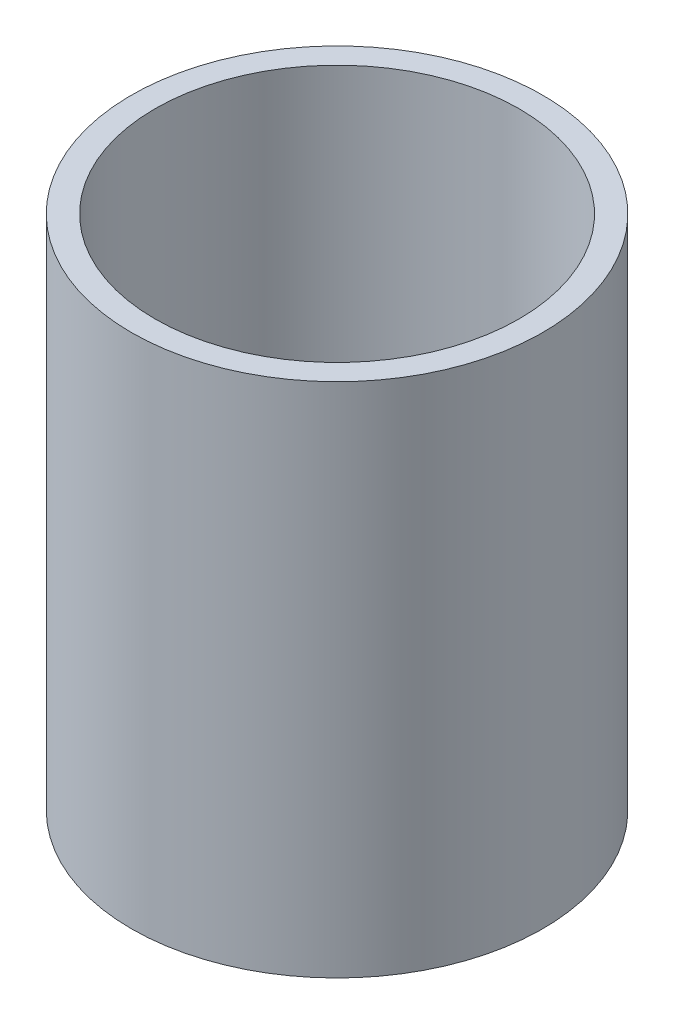
ISO-10303-21;
HEADER;
FILE_DESCRIPTION(('STEP AP214'),'2;1');
FILE_NAME('part.step','',(''),(''),'','','');
FILE_SCHEMA(('AUTOMOTIVE_DESIGN { 1 0 10303 214 1 1 1 1 }'));
ENDSEC;
DATA;
#1=APPLICATION_CONTEXT('core data for automotive mechanical design processes');
#2=APPLICATION_PROTOCOL_DEFINITION('international standard','automotive_design',2000,#1);
#3=PRODUCT_CONTEXT('',#1,'mechanical');
#4=PRODUCT('Part','Part','',(#3));
#5=PRODUCT_RELATED_PRODUCT_CATEGORY('part','',(#4));
#6=PRODUCT_DEFINITION_FORMATION('','',#4);
#7=PRODUCT_DEFINITION_CONTEXT('part definition',#1,'design');
#8=PRODUCT_DEFINITION('design','',#6,#7);
#9=PRODUCT_DEFINITION_SHAPE('','',#8);
#10=(LENGTH_UNIT() NAMED_UNIT(*) SI_UNIT(.MILLI.,.METRE.));
#11=(NAMED_UNIT(*) PLANE_ANGLE_UNIT() SI_UNIT($,.RADIAN.));
#12=(NAMED_UNIT(*) SI_UNIT($,.STERADIAN.) SOLID_ANGLE_UNIT());
#13=UNCERTAINTY_MEASURE_WITH_UNIT(LENGTH_MEASURE(1.E-05),#10,'distance_accuracy_value','');
#14=(GEOMETRIC_REPRESENTATION_CONTEXT(3) GLOBAL_UNCERTAINTY_ASSIGNED_CONTEXT((#13)) GLOBAL_UNIT_ASSIGNED_CONTEXT((#10,
#11,#12)) REPRESENTATION_CONTEXT('',''));
#15=CARTESIAN_POINT('',(0.,0.,0.));
#16=DIRECTION('',(0.,0.,1.));
#17=DIRECTION('',(1.,0.,0.));
#18=AXIS2_PLACEMENT_3D('',#15,#16,#17);
#19=CARTESIAN_POINT('',(0.,138.118839335116,0.));
#20=DIRECTION('',(0.,-1.,0.));
#21=DIRECTION('',(0.,0.,-1.));
#22=AXIS2_PLACEMENT_3D('',#19,#20,#21);
#23=CYLINDRICAL_SURFACE('',#22,55.);
#24=CARTESIAN_POINT('',(0.,138.118839335116,0.));
#25=DIRECTION('',(0.,1.,0.));
#26=DIRECTION('',(0.,0.,1.));
#27=AXIS2_PLACEMENT_3D('',#24,#25,#26);
#28=CIRCLE('',#27,55.);
#29=CARTESIAN_POINT('',(0.,138.118839335116,55.));
#30=VERTEX_POINT('',#29);
#31=EDGE_CURVE('E10',#30,#30,#28,.T.);
#32=ORIENTED_EDGE('',*,*,#31,.F.);
#33=EDGE_LOOP('',(#32));
#34=FACE_BOUND('',#33,.T.);
#35=CARTESIAN_POINT('',(0.,0.,0.));
#36=DIRECTION('',(0.,1.,0.));
#37=DIRECTION('',(0.,0.,1.));
#38=AXIS2_PLACEMENT_3D('',#35,#36,#37);
#39=CIRCLE('',#38,55.);
#40=CARTESIAN_POINT('',(0.,0.,55.));
#41=VERTEX_POINT('',#40);
#42=EDGE_CURVE('E37',#41,#41,#39,.T.);
#43=ORIENTED_EDGE('',*,*,#42,.T.);
#44=EDGE_LOOP('',(#43));
#45=FACE_BOUND('',#44,.T.);
#46=ADVANCED_FACE('F40',(#34,#45),#23,.T.);
#47=CARTESIAN_POINT('',(0.,138.118839335116,0.));
#48=DIRECTION('',(0.,1.,0.));
#49=DIRECTION('',(0.,0.,1.));
#50=AXIS2_PLACEMENT_3D('',#47,#48,#49);
#51=PLANE('',#50);
#52=CARTESIAN_POINT('',(0.,138.118839335116,0.));
#53=DIRECTION('',(0.,1.,0.));
#54=DIRECTION('',(0.,0.,1.));
#55=AXIS2_PLACEMENT_3D('',#52,#53,#54);
#56=CIRCLE('',#55,48.696767732486);
#57=CARTESIAN_POINT('',(0.,138.118839335116,48.696767732486));
#58=VERTEX_POINT('',#57);
#59=EDGE_CURVE('E50',#58,#58,#56,.T.);
#60=ORIENTED_EDGE('',*,*,#59,.F.);
#61=EDGE_LOOP('',(#60));
#62=FACE_BOUND('',#61,.T.);
#63=ORIENTED_EDGE('',*,*,#31,.T.);
#64=EDGE_LOOP('',(#63));
#65=FACE_BOUND('',#64,.T.);
#66=ADVANCED_FACE('F59',(#62,#65),#51,.T.);
#67=CARTESIAN_POINT('',(0.,0.,0.));
#68=DIRECTION('',(0.,1.,0.));
#69=DIRECTION('',(0.,0.,1.));
#70=AXIS2_PLACEMENT_3D('',#67,#68,#69);
#71=PLANE('',#70);
#72=CARTESIAN_POINT('',(0.,0.,0.));
#73=DIRECTION('',(0.,1.,0.));
#74=DIRECTION('',(0.,0.,1.));
#75=AXIS2_PLACEMENT_3D('',#72,#73,#74);
#76=CIRCLE('',#75,48.696767732486);
#77=CARTESIAN_POINT('',(0.,0.,48.696767732486));
#78=VERTEX_POINT('',#77);
#79=EDGE_CURVE('E47',#78,#78,#76,.T.);
#80=ORIENTED_EDGE('',*,*,#79,.T.);
#81=EDGE_LOOP('',(#80));
#82=FACE_BOUND('',#81,.T.);
#83=ORIENTED_EDGE('',*,*,#42,.F.);
#84=EDGE_LOOP('',(#83));
#85=FACE_BOUND('',#84,.T.);
#86=ADVANCED_FACE('F58',(#82,#85),#71,.F.);
#87=CARTESIAN_POINT('',(0.,138.118839335116,0.));
#88=DIRECTION('',(0.,-1.,0.));
#89=DIRECTION('',(0.,0.,-1.));
#90=AXIS2_PLACEMENT_3D('',#87,#88,#89);
#91=CYLINDRICAL_SURFACE('',#90,48.696767732486);
#92=ORIENTED_EDGE('',*,*,#59,.T.);
#93=EDGE_LOOP('',(#92));
#94=FACE_BOUND('',#93,.T.);
#95=ORIENTED_EDGE('',*,*,#79,.F.);
#96=EDGE_LOOP('',(#95));
#97=FACE_BOUND('',#96,.T.);
#98=ADVANCED_FACE('F54',(#94,#97),#91,.F.);
#99=CLOSED_SHELL('',(#46,#66,#86,#98));
#100=MANIFOLD_SOLID_BREP('B2',#99);
#101=ADVANCED_BREP_SHAPE_REPRESENTATION('',(#18,#100),#14);
#102=SHAPE_DEFINITION_REPRESENTATION(#9,#101);
ENDSEC;
END-ISO-10303-21;
